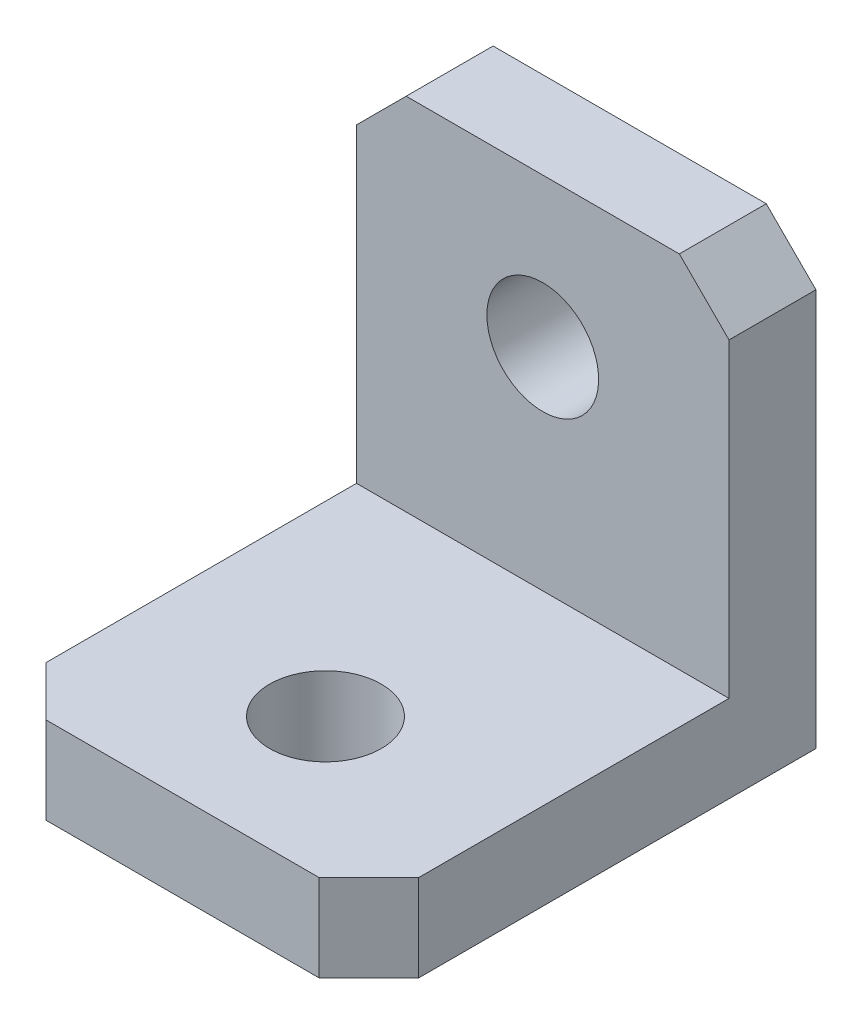
ISO-10303-21;
HEADER;
FILE_DESCRIPTION(('STEP AP214'),'2;1');
FILE_NAME('part.step','',(''),(''),'','','');
FILE_SCHEMA(('AUTOMOTIVE_DESIGN { 1 0 10303 214 1 1 1 1 }'));
ENDSEC;
DATA;
#1=APPLICATION_CONTEXT('core data for automotive mechanical design processes');
#2=APPLICATION_PROTOCOL_DEFINITION('international standard','automotive_design',2000,#1);
#3=PRODUCT_CONTEXT('',#1,'mechanical');
#4=PRODUCT('Part','Part','',(#3));
#5=PRODUCT_RELATED_PRODUCT_CATEGORY('part','',(#4));
#6=PRODUCT_DEFINITION_FORMATION('','',#4);
#7=PRODUCT_DEFINITION_CONTEXT('part definition',#1,'design');
#8=PRODUCT_DEFINITION('design','',#6,#7);
#9=PRODUCT_DEFINITION_SHAPE('','',#8);
#10=(LENGTH_UNIT() NAMED_UNIT(*) SI_UNIT(.MILLI.,.METRE.));
#11=(NAMED_UNIT(*) PLANE_ANGLE_UNIT() SI_UNIT($,.RADIAN.));
#12=(NAMED_UNIT(*) SI_UNIT($,.STERADIAN.) SOLID_ANGLE_UNIT());
#13=UNCERTAINTY_MEASURE_WITH_UNIT(LENGTH_MEASURE(1.E-05),#10,'distance_accuracy_value','');
#14=(GEOMETRIC_REPRESENTATION_CONTEXT(3) GLOBAL_UNCERTAINTY_ASSIGNED_CONTEXT((#13)) GLOBAL_UNIT_ASSIGNED_CONTEXT((#10,
#11,#12)) REPRESENTATION_CONTEXT('',''));
#15=CARTESIAN_POINT('',(0.,0.,0.));
#16=DIRECTION('',(0.,0.,1.));
#17=DIRECTION('',(1.,0.,0.));
#18=AXIS2_PLACEMENT_3D('',#15,#16,#17);
#19=CARTESIAN_POINT('',(7.5,0.,-18.));
#20=DIRECTION('',(0.,1.,0.));
#21=DIRECTION('',(0.,0.,1.));
#22=AXIS2_PLACEMENT_3D('',#19,#20,#21);
#23=PLANE('',#22);
#24=CARTESIAN_POINT('',(0.,0.,-5.75));
#25=DIRECTION('',(0.,-1.,0.));
#26=DIRECTION('',(0.,0.,-1.));
#27=AXIS2_PLACEMENT_3D('',#24,#25,#26);
#28=CIRCLE('',#27,2.25);
#29=CARTESIAN_POINT('',(0.,0.,-8.));
#30=VERTEX_POINT('',#29);
#31=EDGE_CURVE('E166',#30,#30,#28,.T.);
#32=ORIENTED_EDGE('',*,*,#31,.F.);
#33=EDGE_LOOP('',(#32));
#34=FACE_BOUND('',#33,.T.);
#35=DIRECTION('',(-1.,0.,0.));
#36=VECTOR('',#35,1.);
#37=CARTESIAN_POINT('',(7.5,0.,0.));
#38=LINE('',#37,#36);
#39=CARTESIAN_POINT('',(5.49999999999999,0.,0.));
#40=VERTEX_POINT('',#39);
#41=CARTESIAN_POINT('',(-5.5,0.,0.));
#42=VERTEX_POINT('',#41);
#43=EDGE_CURVE('E220',#40,#42,#38,.T.);
#44=ORIENTED_EDGE('',*,*,#43,.T.);
#45=DIRECTION('',(-0.707106781186546,0.,-0.707106781186549));
#46=VECTOR('',#45,1.);
#47=CARTESIAN_POINT('',(-5.5,0.,0.));
#48=LINE('',#47,#46);
#49=CARTESIAN_POINT('',(-7.5,0.,-2.00000000000001));
#50=VERTEX_POINT('',#49);
#51=EDGE_CURVE('E207',#42,#50,#48,.T.);
#52=ORIENTED_EDGE('',*,*,#51,.T.);
#53=DIRECTION('',(0.,0.,-1.));
#54=VECTOR('',#53,1.);
#55=CARTESIAN_POINT('',(-7.5,0.,-18.));
#56=LINE('',#55,#54);
#57=CARTESIAN_POINT('',(-7.5,0.,-18.));
#58=VERTEX_POINT('',#57);
#59=EDGE_CURVE('E148',#50,#58,#56,.T.);
#60=ORIENTED_EDGE('',*,*,#59,.T.);
#61=DIRECTION('',(-1.,0.,0.));
#62=VECTOR('',#61,1.);
#63=CARTESIAN_POINT('',(7.5,0.,-18.));
#64=LINE('',#63,#62);
#65=CARTESIAN_POINT('',(7.5,0.,-18.));
#66=VERTEX_POINT('',#65);
#67=EDGE_CURVE('E140',#66,#58,#64,.T.);
#68=ORIENTED_EDGE('',*,*,#67,.F.);
#69=DIRECTION('',(0.,0.,-1.));
#70=VECTOR('',#69,1.);
#71=CARTESIAN_POINT('',(7.5,0.,-18.));
#72=LINE('',#71,#70);
#73=CARTESIAN_POINT('',(7.5,0.,-2.));
#74=VERTEX_POINT('',#73);
#75=EDGE_CURVE('E121',#74,#66,#72,.T.);
#76=ORIENTED_EDGE('',*,*,#75,.F.);
#77=DIRECTION('',(0.707106781186549,0.,-0.707106781186546));
#78=VECTOR('',#77,1.);
#79=CARTESIAN_POINT('',(7.5,0.,-2.));
#80=LINE('',#79,#78);
#81=EDGE_CURVE('E204',#74,#40,#80,.F.);
#82=ORIENTED_EDGE('',*,*,#81,.T.);
#83=EDGE_LOOP('',(#44,#52,#60,#68,#76,#82));
#84=FACE_BOUND('',#83,.T.);
#85=ADVANCED_FACE('F41',(#34,#84),#23,.F.);
#86=CARTESIAN_POINT('',(7.5,18.,-18.));
#87=DIRECTION('',(0.,0.,1.));
#88=DIRECTION('',(0.,-1.,0.));
#89=AXIS2_PLACEMENT_3D('',#86,#87,#88);
#90=PLANE('',#89);
#91=CARTESIAN_POINT('',(0.,12.,-18.));
#92=DIRECTION('',(0.,0.,-1.));
#93=DIRECTION('',(0.,1.,0.));
#94=AXIS2_PLACEMENT_3D('',#91,#92,#93);
#95=CIRCLE('',#94,2.25);
#96=CARTESIAN_POINT('',(0.,14.25,-18.));
#97=VERTEX_POINT('',#96);
#98=EDGE_CURVE('E170',#97,#97,#95,.T.);
#99=ORIENTED_EDGE('',*,*,#98,.F.);
#100=EDGE_LOOP('',(#99));
#101=FACE_BOUND('',#100,.T.);
#102=DIRECTION('',(-1.,0.,0.));
#103=VECTOR('',#102,1.);
#104=CARTESIAN_POINT('',(7.5,18.,-18.));
#105=LINE('',#104,#103);
#106=CARTESIAN_POINT('',(5.49999999999999,18.,-18.));
#107=VERTEX_POINT('',#106);
#108=CARTESIAN_POINT('',(-5.5,18.,-18.));
#109=VERTEX_POINT('',#108);
#110=EDGE_CURVE('E151',#107,#109,#105,.T.);
#111=ORIENTED_EDGE('',*,*,#110,.F.);
#112=DIRECTION('',(-0.707106781186549,0.707106781186546,0.));
#113=VECTOR('',#112,1.);
#114=CARTESIAN_POINT('',(7.5,16.,-18.));
#115=LINE('',#114,#113);
#116=CARTESIAN_POINT('',(7.5,16.,-18.));
#117=VERTEX_POINT('',#116);
#118=EDGE_CURVE('E142',#107,#117,#115,.F.);
#119=ORIENTED_EDGE('',*,*,#118,.T.);
#120=DIRECTION('',(0.,1.,0.));
#121=VECTOR('',#120,1.);
#122=CARTESIAN_POINT('',(7.5,18.,-18.));
#123=LINE('',#122,#121);
#124=EDGE_CURVE('E125',#66,#117,#123,.T.);
#125=ORIENTED_EDGE('',*,*,#124,.F.);
#126=ORIENTED_EDGE('',*,*,#67,.T.);
#127=DIRECTION('',(0.,1.,0.));
#128=VECTOR('',#127,1.);
#129=CARTESIAN_POINT('',(-7.5,18.,-18.));
#130=LINE('',#129,#128);
#131=CARTESIAN_POINT('',(-7.5,16.,-18.));
#132=VERTEX_POINT('',#131);
#133=EDGE_CURVE('E250',#58,#132,#130,.T.);
#134=ORIENTED_EDGE('',*,*,#133,.T.);
#135=DIRECTION('',(0.707106781186546,0.707106781186549,0.));
#136=VECTOR('',#135,1.);
#137=CARTESIAN_POINT('',(-5.5,18.,-18.));
#138=LINE('',#137,#136);
#139=EDGE_CURVE('E187',#132,#109,#138,.T.);
#140=ORIENTED_EDGE('',*,*,#139,.T.);
#141=EDGE_LOOP('',(#111,#119,#125,#126,#134,#140));
#142=FACE_BOUND('',#141,.T.);
#143=ADVANCED_FACE('F138',(#101,#142),#90,.F.);
#144=CARTESIAN_POINT('',(7.5,18.,-14.5));
#145=DIRECTION('',(0.,-1.,0.));
#146=DIRECTION('',(0.,0.,-1.));
#147=AXIS2_PLACEMENT_3D('',#144,#145,#146);
#148=PLANE('',#147);
#149=DIRECTION('',(-1.,0.,0.));
#150=VECTOR('',#149,1.);
#151=CARTESIAN_POINT('',(7.5,18.,-14.5));
#152=LINE('',#151,#150);
#153=CARTESIAN_POINT('',(5.49999999999999,18.,-14.5));
#154=VERTEX_POINT('',#153);
#155=CARTESIAN_POINT('',(-5.5,18.,-14.5));
#156=VERTEX_POINT('',#155);
#157=EDGE_CURVE('E158',#154,#156,#152,.T.);
#158=ORIENTED_EDGE('',*,*,#157,.F.);
#159=DIRECTION('',(0.,0.,-1.));
#160=VECTOR('',#159,1.);
#161=CARTESIAN_POINT('',(5.49999999999999,18.,-14.5));
#162=LINE('',#161,#160);
#163=EDGE_CURVE('E184',#154,#107,#162,.T.);
#164=ORIENTED_EDGE('',*,*,#163,.T.);
#165=ORIENTED_EDGE('',*,*,#110,.T.);
#166=DIRECTION('',(0.,0.,1.));
#167=VECTOR('',#166,1.);
#168=CARTESIAN_POINT('',(-5.5,18.,-14.5));
#169=LINE('',#168,#167);
#170=EDGE_CURVE('E180',#109,#156,#169,.T.);
#171=ORIENTED_EDGE('',*,*,#170,.T.);
#172=EDGE_LOOP('',(#158,#164,#165,#171));
#173=FACE_BOUND('',#172,.T.);
#174=ADVANCED_FACE('F241',(#173),#148,.F.);
#175=CARTESIAN_POINT('',(7.5,3.5,-14.5));
#176=DIRECTION('',(0.,0.,-1.));
#177=DIRECTION('',(-1.,0.,0.));
#178=AXIS2_PLACEMENT_3D('',#175,#176,#177);
#179=PLANE('',#178);
#180=CARTESIAN_POINT('',(0.,12.,-14.5));
#181=DIRECTION('',(0.,0.,-1.));
#182=DIRECTION('',(-1.,0.,0.));
#183=AXIS2_PLACEMENT_3D('',#180,#181,#182);
#184=CIRCLE('',#183,2.25);
#185=CARTESIAN_POINT('',(-2.25,12.,-14.5));
#186=VERTEX_POINT('',#185);
#187=EDGE_CURVE('E167',#186,#186,#184,.T.);
#188=ORIENTED_EDGE('',*,*,#187,.T.);
#189=EDGE_LOOP('',(#188));
#190=FACE_BOUND('',#189,.T.);
#191=DIRECTION('',(0.,-1.,0.));
#192=VECTOR('',#191,1.);
#193=CARTESIAN_POINT('',(7.5,3.5,-14.5));
#194=LINE('',#193,#192);
#195=CARTESIAN_POINT('',(7.5,16.,-14.5));
#196=VERTEX_POINT('',#195);
#197=CARTESIAN_POINT('',(7.5,3.5,-14.5));
#198=VERTEX_POINT('',#197);
#199=EDGE_CURVE('E144',#196,#198,#194,.T.);
#200=ORIENTED_EDGE('',*,*,#199,.F.);
#201=DIRECTION('',(0.707106781186549,-0.707106781186546,0.));
#202=VECTOR('',#201,1.);
#203=CARTESIAN_POINT('',(7.5,16.,-14.5));
#204=LINE('',#203,#202);
#205=EDGE_CURVE('E177',#196,#154,#204,.F.);
#206=ORIENTED_EDGE('',*,*,#205,.T.);
#207=ORIENTED_EDGE('',*,*,#157,.T.);
#208=DIRECTION('',(-0.707106781186546,-0.707106781186549,0.));
#209=VECTOR('',#208,1.);
#210=CARTESIAN_POINT('',(-5.5,18.,-14.5));
#211=LINE('',#210,#209);
#212=CARTESIAN_POINT('',(-7.5,16.,-14.5));
#213=VERTEX_POINT('',#212);
#214=EDGE_CURVE('E174',#156,#213,#211,.T.);
#215=ORIENTED_EDGE('',*,*,#214,.T.);
#216=DIRECTION('',(0.,-1.,0.));
#217=VECTOR('',#216,1.);
#218=CARTESIAN_POINT('',(-7.5,3.5,-14.5));
#219=LINE('',#218,#217);
#220=CARTESIAN_POINT('',(-7.5,3.5,-14.5));
#221=VERTEX_POINT('',#220);
#222=EDGE_CURVE('E252',#213,#221,#219,.T.);
#223=ORIENTED_EDGE('',*,*,#222,.T.);
#224=DIRECTION('',(-1.,0.,0.));
#225=VECTOR('',#224,1.);
#226=CARTESIAN_POINT('',(7.5,3.5,-14.5));
#227=LINE('',#226,#225);
#228=EDGE_CURVE('E227',#198,#221,#227,.T.);
#229=ORIENTED_EDGE('',*,*,#228,.F.);
#230=EDGE_LOOP('',(#200,#206,#207,#215,#223,#229));
#231=FACE_BOUND('',#230,.T.);
#232=ADVANCED_FACE('F237',(#190,#231),#179,.F.);
#233=CARTESIAN_POINT('',(7.5,3.5,0.));
#234=DIRECTION('',(0.,-1.,0.));
#235=DIRECTION('',(0.,0.,-1.));
#236=AXIS2_PLACEMENT_3D('',#233,#234,#235);
#237=PLANE('',#236);
#238=CARTESIAN_POINT('',(0.,3.5,-5.75));
#239=DIRECTION('',(0.,-1.,0.));
#240=DIRECTION('',(0.,0.,-1.));
#241=AXIS2_PLACEMENT_3D('',#238,#239,#240);
#242=CIRCLE('',#241,2.25);
#243=CARTESIAN_POINT('',(0.,3.5,-8.));
#244=VERTEX_POINT('',#243);
#245=EDGE_CURVE('E162',#244,#244,#242,.T.);
#246=ORIENTED_EDGE('',*,*,#245,.T.);
#247=EDGE_LOOP('',(#246));
#248=FACE_BOUND('',#247,.T.);
#249=DIRECTION('',(0.,0.,1.));
#250=VECTOR('',#249,1.);
#251=CARTESIAN_POINT('',(-7.5,3.5,0.));
#252=LINE('',#251,#250);
#253=CARTESIAN_POINT('',(-7.5,3.5,-2.));
#254=VERTEX_POINT('',#253);
#255=EDGE_CURVE('E133',#221,#254,#252,.T.);
#256=ORIENTED_EDGE('',*,*,#255,.T.);
#257=DIRECTION('',(0.707106781186546,0.,0.707106781186549));
#258=VECTOR('',#257,1.);
#259=CARTESIAN_POINT('',(-5.5,3.5,0.));
#260=LINE('',#259,#258);
#261=CARTESIAN_POINT('',(-5.5,3.5,0.));
#262=VERTEX_POINT('',#261);
#263=EDGE_CURVE('E11',#254,#262,#260,.T.);
#264=ORIENTED_EDGE('',*,*,#263,.T.);
#265=DIRECTION('',(-1.,0.,0.));
#266=VECTOR('',#265,1.);
#267=CARTESIAN_POINT('',(7.5,3.5,0.));
#268=LINE('',#267,#266);
#269=CARTESIAN_POINT('',(5.49999999999999,3.5,0.));
#270=VERTEX_POINT('',#269);
#271=EDGE_CURVE('E215',#270,#262,#268,.T.);
#272=ORIENTED_EDGE('',*,*,#271,.F.);
#273=DIRECTION('',(-0.707106781186549,0.,0.707106781186546));
#274=VECTOR('',#273,1.);
#275=CARTESIAN_POINT('',(7.5,3.5,-2.));
#276=LINE('',#275,#274);
#277=CARTESIAN_POINT('',(7.5,3.5,-2.));
#278=VERTEX_POINT('',#277);
#279=EDGE_CURVE('E51',#270,#278,#276,.F.);
#280=ORIENTED_EDGE('',*,*,#279,.T.);
#281=DIRECTION('',(0.,0.,1.));
#282=VECTOR('',#281,1.);
#283=CARTESIAN_POINT('',(7.5,3.5,0.));
#284=LINE('',#283,#282);
#285=EDGE_CURVE('E214',#198,#278,#284,.T.);
#286=ORIENTED_EDGE('',*,*,#285,.F.);
#287=ORIENTED_EDGE('',*,*,#228,.T.);
#288=EDGE_LOOP('',(#256,#264,#272,#280,#286,#287));
#289=FACE_BOUND('',#288,.T.);
#290=ADVANCED_FACE('F212',(#248,#289),#237,.F.);
#291=CARTESIAN_POINT('',(7.5,0.,0.));
#292=DIRECTION('',(0.,0.,-1.));
#293=DIRECTION('',(-1.,0.,0.));
#294=AXIS2_PLACEMENT_3D('',#291,#292,#293);
#295=PLANE('',#294);
#296=ORIENTED_EDGE('',*,*,#271,.T.);
#297=DIRECTION('',(0.,-1.,0.));
#298=VECTOR('',#297,1.);
#299=CARTESIAN_POINT('',(-5.5,0.,0.));
#300=LINE('',#299,#298);
#301=EDGE_CURVE('E200',#262,#42,#300,.T.);
#302=ORIENTED_EDGE('',*,*,#301,.T.);
#303=ORIENTED_EDGE('',*,*,#43,.F.);
#304=DIRECTION('',(0.,1.,0.));
#305=VECTOR('',#304,1.);
#306=CARTESIAN_POINT('',(5.49999999999999,0.,0.));
#307=LINE('',#306,#305);
#308=EDGE_CURVE('E63',#40,#270,#307,.T.);
#309=ORIENTED_EDGE('',*,*,#308,.T.);
#310=EDGE_LOOP('',(#296,#302,#303,#309));
#311=FACE_BOUND('',#310,.T.);
#312=ADVANCED_FACE('F222',(#311),#295,.F.);
#313=CARTESIAN_POINT('',(7.5,0.,0.));
#314=DIRECTION('',(-1.,0.,0.));
#315=DIRECTION('',(0.,0.,1.));
#316=AXIS2_PLACEMENT_3D('',#313,#314,#315);
#317=PLANE('',#316);
#318=ORIENTED_EDGE('',*,*,#124,.T.);
#319=DIRECTION('',(0.,0.,1.));
#320=VECTOR('',#319,1.);
#321=CARTESIAN_POINT('',(7.5,16.,0.));
#322=LINE('',#321,#320);
#323=EDGE_CURVE('E155',#117,#196,#322,.T.);
#324=ORIENTED_EDGE('',*,*,#323,.T.);
#325=ORIENTED_EDGE('',*,*,#199,.T.);
#326=ORIENTED_EDGE('',*,*,#285,.T.);
#327=DIRECTION('',(0.,-1.,0.));
#328=VECTOR('',#327,1.);
#329=CARTESIAN_POINT('',(7.5,0.,-2.));
#330=LINE('',#329,#328);
#331=EDGE_CURVE('E129',#278,#74,#330,.T.);
#332=ORIENTED_EDGE('',*,*,#331,.T.);
#333=ORIENTED_EDGE('',*,*,#75,.T.);
#334=EDGE_LOOP('',(#318,#324,#325,#326,#332,#333));
#335=FACE_BOUND('',#334,.T.);
#336=ADVANCED_FACE('F123',(#335),#317,.F.);
#337=CARTESIAN_POINT('',(-7.5,0.,0.));
#338=DIRECTION('',(-1.,0.,0.));
#339=DIRECTION('',(0.,0.,1.));
#340=AXIS2_PLACEMENT_3D('',#337,#338,#339);
#341=PLANE('',#340);
#342=ORIENTED_EDGE('',*,*,#222,.F.);
#343=DIRECTION('',(0.,0.,-1.));
#344=VECTOR('',#343,1.);
#345=CARTESIAN_POINT('',(-7.5,16.,-18.));
#346=LINE('',#345,#344);
#347=EDGE_CURVE('E195',#213,#132,#346,.T.);
#348=ORIENTED_EDGE('',*,*,#347,.T.);
#349=ORIENTED_EDGE('',*,*,#133,.F.);
#350=ORIENTED_EDGE('',*,*,#59,.F.);
#351=DIRECTION('',(0.,1.,0.));
#352=VECTOR('',#351,1.);
#353=CARTESIAN_POINT('',(-7.5,3.5,-2.00000000000001));
#354=LINE('',#353,#352);
#355=EDGE_CURVE('E192',#50,#254,#354,.T.);
#356=ORIENTED_EDGE('',*,*,#355,.T.);
#357=ORIENTED_EDGE('',*,*,#255,.F.);
#358=EDGE_LOOP('',(#342,#348,#349,#350,#356,#357));
#359=FACE_BOUND('',#358,.T.);
#360=ADVANCED_FACE('F260',(#359),#341,.T.);
#361=CARTESIAN_POINT('',(0.,15.,-5.75));
#362=DIRECTION('',(0.,-1.,0.));
#363=DIRECTION('',(0.,0.,-1.));
#364=AXIS2_PLACEMENT_3D('',#361,#362,#363);
#365=CYLINDRICAL_SURFACE('',#364,2.25);
#366=ORIENTED_EDGE('',*,*,#31,.T.);
#367=EDGE_LOOP('',(#366));
#368=FACE_BOUND('',#367,.T.);
#369=ORIENTED_EDGE('',*,*,#245,.F.);
#370=EDGE_LOOP('',(#369));
#371=FACE_BOUND('',#370,.T.);
#372=ADVANCED_FACE('F306',(#368,#371),#365,.F.);
#373=CARTESIAN_POINT('',(0.,12.,-3.));
#374=DIRECTION('',(0.,0.,-1.));
#375=DIRECTION('',(0.,1.,0.));
#376=AXIS2_PLACEMENT_3D('',#373,#374,#375);
#377=CYLINDRICAL_SURFACE('',#376,2.25);
#378=ORIENTED_EDGE('',*,*,#98,.T.);
#379=EDGE_LOOP('',(#378));
#380=FACE_BOUND('',#379,.T.);
#381=ORIENTED_EDGE('',*,*,#187,.F.);
#382=EDGE_LOOP('',(#381));
#383=FACE_BOUND('',#382,.T.);
#384=ADVANCED_FACE('F271',(#380,#383),#377,.F.);
#385=CARTESIAN_POINT('',(7.5,16.,0.));
#386=DIRECTION('',(-0.707106781186546,-0.707106781186549,0.));
#387=DIRECTION('',(0.,0.,1.));
#388=AXIS2_PLACEMENT_3D('',#385,#386,#387);
#389=PLANE('',#388);
#390=ORIENTED_EDGE('',*,*,#118,.F.);
#391=ORIENTED_EDGE('',*,*,#163,.F.);
#392=ORIENTED_EDGE('',*,*,#205,.F.);
#393=ORIENTED_EDGE('',*,*,#323,.F.);
#394=EDGE_LOOP('',(#390,#391,#392,#393));
#395=FACE_BOUND('',#394,.T.);
#396=ADVANCED_FACE('F244',(#395),#389,.F.);
#397=CARTESIAN_POINT('',(-5.5,18.,-14.5));
#398=DIRECTION('',(-0.707106781186549,0.707106781186546,0.));
#399=DIRECTION('',(0.,0.,-1.));
#400=AXIS2_PLACEMENT_3D('',#397,#398,#399);
#401=PLANE('',#400);
#402=ORIENTED_EDGE('',*,*,#139,.F.);
#403=ORIENTED_EDGE('',*,*,#347,.F.);
#404=ORIENTED_EDGE('',*,*,#214,.F.);
#405=ORIENTED_EDGE('',*,*,#170,.F.);
#406=EDGE_LOOP('',(#402,#403,#404,#405));
#407=FACE_BOUND('',#406,.T.);
#408=ADVANCED_FACE('F264',(#407),#401,.T.);
#409=CARTESIAN_POINT('',(-5.5,0.,0.));
#410=DIRECTION('',(-0.707106781186549,0.,0.707106781186546));
#411=DIRECTION('',(0.,1.,0.));
#412=AXIS2_PLACEMENT_3D('',#409,#410,#411);
#413=PLANE('',#412);
#414=ORIENTED_EDGE('',*,*,#263,.F.);
#415=ORIENTED_EDGE('',*,*,#355,.F.);
#416=ORIENTED_EDGE('',*,*,#51,.F.);
#417=ORIENTED_EDGE('',*,*,#301,.F.);
#418=EDGE_LOOP('',(#414,#415,#416,#417));
#419=FACE_BOUND('',#418,.T.);
#420=ADVANCED_FACE('F259',(#419),#413,.T.);
#421=CARTESIAN_POINT('',(7.5,0.,-2.));
#422=DIRECTION('',(-0.707106781186546,0.,-0.707106781186549));
#423=DIRECTION('',(0.,-1.,0.));
#424=AXIS2_PLACEMENT_3D('',#421,#422,#423);
#425=PLANE('',#424);
#426=ORIENTED_EDGE('',*,*,#279,.F.);
#427=ORIENTED_EDGE('',*,*,#308,.F.);
#428=ORIENTED_EDGE('',*,*,#81,.F.);
#429=ORIENTED_EDGE('',*,*,#331,.F.);
#430=EDGE_LOOP('',(#426,#427,#428,#429));
#431=FACE_BOUND('',#430,.T.);
#432=ADVANCED_FACE('F44',(#431),#425,.F.);
#433=CLOSED_SHELL('',(#85,#143,#174,#232,#290,#312,#336,#360,#372,#384,#396,#408,#420,#432));
#434=MANIFOLD_SOLID_BREP('B2',#433);
#435=ADVANCED_BREP_SHAPE_REPRESENTATION('',(#18,#434),#14);
#436=SHAPE_DEFINITION_REPRESENTATION(#9,#435);
ENDSEC;
END-ISO-10303-21;
